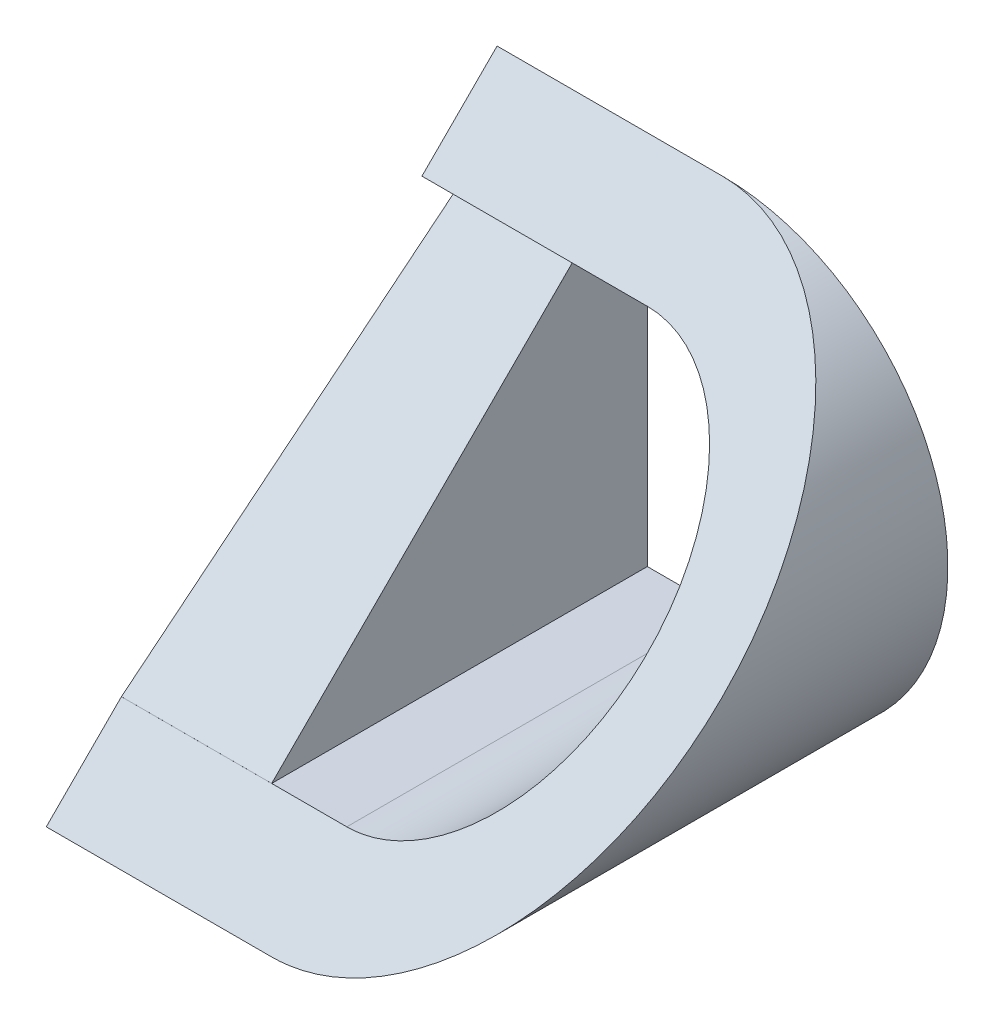
ISO-10303-21;
HEADER;
FILE_DESCRIPTION(('STEP AP214'),'2;1');
FILE_NAME('part.step','',(''),(''),'','','');
FILE_SCHEMA(('AUTOMOTIVE_DESIGN { 1 0 10303 214 1 1 1 1 }'));
ENDSEC;
DATA;
#1=APPLICATION_CONTEXT('core data for automotive mechanical design processes');
#2=APPLICATION_PROTOCOL_DEFINITION('international standard','automotive_design',2000,#1);
#3=PRODUCT_CONTEXT('',#1,'mechanical');
#4=PRODUCT('Part','Part','',(#3));
#5=PRODUCT_RELATED_PRODUCT_CATEGORY('part','',(#4));
#6=PRODUCT_DEFINITION_FORMATION('','',#4);
#7=PRODUCT_DEFINITION_CONTEXT('part definition',#1,'design');
#8=PRODUCT_DEFINITION('design','',#6,#7);
#9=PRODUCT_DEFINITION_SHAPE('','',#8);
#10=(LENGTH_UNIT() NAMED_UNIT(*) SI_UNIT(.MILLI.,.METRE.));
#11=(NAMED_UNIT(*) PLANE_ANGLE_UNIT() SI_UNIT($,.RADIAN.));
#12=(NAMED_UNIT(*) SI_UNIT($,.STERADIAN.) SOLID_ANGLE_UNIT());
#13=UNCERTAINTY_MEASURE_WITH_UNIT(LENGTH_MEASURE(1.E-05),#10,'distance_accuracy_value','');
#14=(GEOMETRIC_REPRESENTATION_CONTEXT(3) GLOBAL_UNCERTAINTY_ASSIGNED_CONTEXT((#13)) GLOBAL_UNIT_ASSIGNED_CONTEXT((#10,
#11,#12)) REPRESENTATION_CONTEXT('',''));
#15=CARTESIAN_POINT('',(0.,0.,0.));
#16=DIRECTION('',(0.,0.,1.));
#17=DIRECTION('',(1.,0.,0.));
#18=AXIS2_PLACEMENT_3D('',#15,#16,#17);
#19=CARTESIAN_POINT('',(30.,30.,60.));
#20=DIRECTION('',(0.,0.,-1.));
#21=DIRECTION('',(-1.,0.,0.));
#22=AXIS2_PLACEMENT_3D('',#19,#20,#21);
#23=CYLINDRICAL_SURFACE('',#22,30.);
#24=CARTESIAN_POINT('',(30.,30.,30.));
#25=DIRECTION('',(0.,-0.707106781186547,-0.707106781186547));
#26=DIRECTION('',(0.,0.707106781186548,-0.707106781186548));
#27=AXIS2_PLACEMENT_3D('',#24,#25,#26);
#28=ELLIPSE('',#27,42.4264068711929,30.);
#29=CARTESIAN_POINT('',(30.,0.,60.));
#30=VERTEX_POINT('',#29);
#31=CARTESIAN_POINT('',(30.,60.,0.));
#32=VERTEX_POINT('',#31);
#33=EDGE_CURVE('E167',#30,#32,#28,.F.);
#34=ORIENTED_EDGE('',*,*,#33,.F.);
#35=DIRECTION('',(0.,0.,-1.));
#36=VECTOR('',#35,1.);
#37=CARTESIAN_POINT('',(30.,0.,60.));
#38=LINE('',#37,#36);
#39=CARTESIAN_POINT('',(30.,0.,0.));
#40=VERTEX_POINT('',#39);
#41=EDGE_CURVE('E172',#30,#40,#38,.T.);
#42=ORIENTED_EDGE('',*,*,#41,.T.);
#43=CARTESIAN_POINT('',(30.,30.,0.));
#44=DIRECTION('',(0.,0.,1.));
#45=DIRECTION('',(1.,0.,0.));
#46=AXIS2_PLACEMENT_3D('',#43,#44,#45);
#47=CIRCLE('',#46,30.);
#48=EDGE_CURVE('E169',#32,#40,#47,.F.);
#49=ORIENTED_EDGE('',*,*,#48,.F.);
#50=EDGE_LOOP('',(#34,#42,#49));
#51=FACE_BOUND('',#50,.T.);
#52=ADVANCED_FACE('F35',(#51),#23,.T.);
#53=CARTESIAN_POINT('',(0.,0.,60.));
#54=DIRECTION('',(-1.,0.,0.));
#55=DIRECTION('',(0.,0.,1.));
#56=AXIS2_PLACEMENT_3D('',#53,#54,#55);
#57=PLANE('',#56);
#58=DIRECTION('',(0.,0.,1.));
#59=VECTOR('',#58,1.);
#60=CARTESIAN_POINT('',(0.,10.00000000225,49.99999999775));
#61=LINE('',#60,#59);
#62=CARTESIAN_POINT('',(0.,10.00000000225,49.9969073546457));
#63=VERTEX_POINT('',#62);
#64=CARTESIAN_POINT('',(0.,10.00000000225,49.99999999775));
#65=VERTEX_POINT('',#64);
#66=EDGE_CURVE('E134',#63,#65,#61,.T.);
#67=ORIENTED_EDGE('',*,*,#66,.F.);
#68=DIRECTION('',(0.,-0.6304550625421,0.77622574945375));
#69=VECTOR('',#68,1.);
#70=CARTESIAN_POINT('',(0.,10.00000000225,49.9969073546457));
#71=LINE('',#70,#69);
#72=CARTESIAN_POINT('',(0.,50.,0.748306112221542));
#73=VERTEX_POINT('',#72);
#74=EDGE_CURVE('E241',#73,#63,#71,.T.);
#75=ORIENTED_EDGE('',*,*,#74,.F.);
#76=DIRECTION('',(0.,0.,-1.));
#77=VECTOR('',#76,1.);
#78=CARTESIAN_POINT('',(0.,50.,0.748306112221542));
#79=LINE('',#78,#77);
#80=CARTESIAN_POINT('',(0.,50.,10.));
#81=VERTEX_POINT('',#80);
#82=EDGE_CURVE('E239',#81,#73,#79,.T.);
#83=ORIENTED_EDGE('',*,*,#82,.F.);
#84=DIRECTION('',(0.,-0.707106781186547,0.707106781186547));
#85=VECTOR('',#84,1.);
#86=CARTESIAN_POINT('',(0.,60.,0.));
#87=LINE('',#86,#85);
#88=CARTESIAN_POINT('',(0.,60.,0.));
#89=VERTEX_POINT('',#88);
#90=EDGE_CURVE('E139',#89,#81,#87,.T.);
#91=ORIENTED_EDGE('',*,*,#90,.F.);
#92=DIRECTION('',(0.,1.,0.));
#93=VECTOR('',#92,1.);
#94=CARTESIAN_POINT('',(0.,0.,0.));
#95=LINE('',#94,#93);
#96=CARTESIAN_POINT('',(0.,0.,0.));
#97=VERTEX_POINT('',#96);
#98=EDGE_CURVE('E179',#97,#89,#95,.T.);
#99=ORIENTED_EDGE('',*,*,#98,.F.);
#100=DIRECTION('',(0.,0.,-1.));
#101=VECTOR('',#100,1.);
#102=CARTESIAN_POINT('',(0.,0.,60.));
#103=LINE('',#102,#101);
#104=CARTESIAN_POINT('',(0.,0.,60.));
#105=VERTEX_POINT('',#104);
#106=EDGE_CURVE('E185',#105,#97,#103,.T.);
#107=ORIENTED_EDGE('',*,*,#106,.F.);
#108=EDGE_CURVE('E160',#65,#105,#87,.T.);
#109=ORIENTED_EDGE('',*,*,#108,.F.);
#110=EDGE_LOOP('',(#67,#75,#83,#91,#99,#107,#109));
#111=FACE_BOUND('',#110,.T.);
#112=ADVANCED_FACE('F221',(#111),#57,.T.);
#113=CARTESIAN_POINT('',(0.,0.,60.));
#114=DIRECTION('',(0.,1.,0.));
#115=DIRECTION('',(0.,0.,1.));
#116=AXIS2_PLACEMENT_3D('',#113,#114,#115);
#117=PLANE('',#116);
#118=DIRECTION('',(1.,0.,0.));
#119=VECTOR('',#118,1.);
#120=CARTESIAN_POINT('',(0.,0.,0.));
#121=LINE('',#120,#119);
#122=EDGE_CURVE('E173',#97,#40,#121,.T.);
#123=ORIENTED_EDGE('',*,*,#122,.T.);
#124=ORIENTED_EDGE('',*,*,#41,.F.);
#125=DIRECTION('',(1.,0.,0.));
#126=VECTOR('',#125,1.);
#127=CARTESIAN_POINT('',(0.,0.,60.));
#128=LINE('',#127,#126);
#129=EDGE_CURVE('E170',#105,#30,#128,.T.);
#130=ORIENTED_EDGE('',*,*,#129,.F.);
#131=ORIENTED_EDGE('',*,*,#106,.T.);
#132=EDGE_LOOP('',(#123,#124,#130,#131));
#133=FACE_BOUND('',#132,.T.);
#134=ADVANCED_FACE('F227',(#133),#117,.F.);
#135=CARTESIAN_POINT('',(0.,0.,0.));
#136=DIRECTION('',(0.,0.,1.));
#137=DIRECTION('',(1.,0.,0.));
#138=AXIS2_PLACEMENT_3D('',#135,#136,#137);
#139=PLANE('',#138);
#140=DIRECTION('',(-1.,0.,0.));
#141=VECTOR('',#140,1.);
#142=CARTESIAN_POINT('',(20.0003,10.00000000225,0.));
#143=LINE('',#142,#141);
#144=CARTESIAN_POINT('',(30.0003,10.00000000225,0.));
#145=VERTEX_POINT('',#144);
#146=CARTESIAN_POINT('',(20.0003,10.00000000225,0.));
#147=VERTEX_POINT('',#146);
#148=EDGE_CURVE('E147',#145,#147,#143,.T.);
#149=ORIENTED_EDGE('',*,*,#148,.F.);
#150=CARTESIAN_POINT('',(30.,30.,0.));
#151=DIRECTION('',(0.,0.,-1.));
#152=DIRECTION('',(-1.,0.,0.));
#153=AXIS2_PLACEMENT_3D('',#150,#151,#152);
#154=CIRCLE('',#153,20.);
#155=CARTESIAN_POINT('',(30.,50.,0.));
#156=VERTEX_POINT('',#155);
#157=EDGE_CURVE('E57',#156,#145,#154,.T.);
#158=ORIENTED_EDGE('',*,*,#157,.F.);
#159=DIRECTION('',(1.,0.,0.));
#160=VECTOR('',#159,1.);
#161=CARTESIAN_POINT('',(30.,50.,0.));
#162=LINE('',#161,#160);
#163=CARTESIAN_POINT('',(20.0003,50.,0.));
#164=VERTEX_POINT('',#163);
#165=EDGE_CURVE('E154',#164,#156,#162,.T.);
#166=ORIENTED_EDGE('',*,*,#165,.F.);
#167=DIRECTION('',(0.,1.,0.));
#168=VECTOR('',#167,1.);
#169=CARTESIAN_POINT('',(20.0003,50.,0.));
#170=LINE('',#169,#168);
#171=EDGE_CURVE('E151',#147,#164,#170,.T.);
#172=ORIENTED_EDGE('',*,*,#171,.F.);
#173=EDGE_LOOP('',(#149,#158,#166,#172));
#174=FACE_BOUND('',#173,.T.);
#175=ORIENTED_EDGE('',*,*,#48,.T.);
#176=ORIENTED_EDGE('',*,*,#122,.F.);
#177=ORIENTED_EDGE('',*,*,#98,.T.);
#178=DIRECTION('',(1.,0.,0.));
#179=VECTOR('',#178,1.);
#180=CARTESIAN_POINT('',(0.,60.,0.));
#181=LINE('',#180,#179);
#182=EDGE_CURVE('E176',#89,#32,#181,.T.);
#183=ORIENTED_EDGE('',*,*,#182,.T.);
#184=EDGE_LOOP('',(#175,#176,#177,#183));
#185=FACE_BOUND('',#184,.T.);
#186=ADVANCED_FACE('F205',(#174,#185),#139,.F.);
#187=CARTESIAN_POINT('',(60.,60.,0.));
#188=DIRECTION('',(0.,-0.707106781186547,-0.707106781186547));
#189=DIRECTION('',(0.,0.707106781186548,-0.707106781186548));
#190=AXIS2_PLACEMENT_3D('',#187,#188,#189);
#191=PLANE('',#190);
#192=DIRECTION('',(1.,0.,0.));
#193=VECTOR('',#192,1.);
#194=CARTESIAN_POINT('',(60.,50.,9.99999999999999));
#195=LINE('',#194,#193);
#196=CARTESIAN_POINT('',(20.0003,50.,10.));
#197=VERTEX_POINT('',#196);
#198=CARTESIAN_POINT('',(30.,50.,9.99999999999999));
#199=VERTEX_POINT('',#198);
#200=EDGE_CURVE('E42',#197,#199,#195,.T.);
#201=ORIENTED_EDGE('',*,*,#200,.T.);
#202=CARTESIAN_POINT('',(30.,30.,30.));
#203=DIRECTION('',(0.,-0.707106781186547,-0.707106781186547));
#204=DIRECTION('',(0.,0.707106781186548,-0.707106781186548));
#205=AXIS2_PLACEMENT_3D('',#202,#203,#204);
#206=ELLIPSE('',#205,28.2842712474619,20.);
#207=CARTESIAN_POINT('',(30.0003,10.00000000225,49.99999999775));
#208=VERTEX_POINT('',#207);
#209=EDGE_CURVE('E11',#199,#208,#206,.T.);
#210=ORIENTED_EDGE('',*,*,#209,.T.);
#211=DIRECTION('',(-1.,0.,0.));
#212=VECTOR('',#211,1.);
#213=CARTESIAN_POINT('',(60.,10.00000000225,49.99999999775));
#214=LINE('',#213,#212);
#215=CARTESIAN_POINT('',(20.0003,10.00000000225,49.99999999775));
#216=VERTEX_POINT('',#215);
#217=EDGE_CURVE('E187',#208,#216,#214,.T.);
#218=ORIENTED_EDGE('',*,*,#217,.T.);
#219=DIRECTION('',(0.,0.707106781186548,-0.707106781186548));
#220=VECTOR('',#219,1.);
#221=CARTESIAN_POINT('',(20.0003,60.,0.));
#222=LINE('',#221,#220);
#223=EDGE_CURVE('E190',#216,#197,#222,.T.);
#224=ORIENTED_EDGE('',*,*,#223,.T.);
#225=EDGE_LOOP('',(#201,#210,#218,#224));
#226=FACE_BOUND('',#225,.T.);
#227=DIRECTION('',(0.,0.707106781186548,-0.707106781186547));
#228=VECTOR('',#227,1.);
#229=CARTESIAN_POINT('',(20.,50.,10.));
#230=LINE('',#229,#228);
#231=CARTESIAN_POINT('',(20.,10.00000000225,49.99999999775));
#232=VERTEX_POINT('',#231);
#233=CARTESIAN_POINT('',(20.,50.,10.));
#234=VERTEX_POINT('',#233);
#235=EDGE_CURVE('E128',#232,#234,#230,.T.);
#236=ORIENTED_EDGE('',*,*,#235,.F.);
#237=DIRECTION('',(-1.,0.,0.));
#238=VECTOR('',#237,1.);
#239=CARTESIAN_POINT('',(20.,10.00000000225,49.99999999775));
#240=LINE('',#239,#238);
#241=EDGE_CURVE('E148',#232,#65,#240,.T.);
#242=ORIENTED_EDGE('',*,*,#241,.T.);
#243=ORIENTED_EDGE('',*,*,#108,.T.);
#244=ORIENTED_EDGE('',*,*,#129,.T.);
#245=ORIENTED_EDGE('',*,*,#33,.T.);
#246=ORIENTED_EDGE('',*,*,#182,.F.);
#247=ORIENTED_EDGE('',*,*,#90,.T.);
#248=DIRECTION('',(-1.,0.,0.));
#249=VECTOR('',#248,1.);
#250=CARTESIAN_POINT('',(20.,50.,10.));
#251=LINE('',#250,#249);
#252=EDGE_CURVE('E123',#234,#81,#251,.T.);
#253=ORIENTED_EDGE('',*,*,#252,.F.);
#254=EDGE_LOOP('',(#236,#242,#243,#244,#245,#246,#247,#253));
#255=FACE_BOUND('',#254,.T.);
#256=ADVANCED_FACE('F137',(#226,#255),#191,.F.);
#257=CARTESIAN_POINT('',(30.,30.,60.));
#258=DIRECTION('',(0.,0.,-1.));
#259=DIRECTION('',(-1.,0.,0.));
#260=AXIS2_PLACEMENT_3D('',#257,#258,#259);
#261=CYLINDRICAL_SURFACE('',#260,20.);
#262=DIRECTION('',(0.,0.,-1.));
#263=VECTOR('',#262,1.);
#264=CARTESIAN_POINT('',(30.,50.,60.));
#265=LINE('',#264,#263);
#266=EDGE_CURVE('E158',#199,#156,#265,.T.);
#267=ORIENTED_EDGE('',*,*,#266,.T.);
#268=ORIENTED_EDGE('',*,*,#157,.T.);
#269=DIRECTION('',(0.,0.,-1.));
#270=VECTOR('',#269,1.);
#271=CARTESIAN_POINT('',(30.0003,10.00000000225,60.));
#272=LINE('',#271,#270);
#273=EDGE_CURVE('E157',#208,#145,#272,.T.);
#274=ORIENTED_EDGE('',*,*,#273,.F.);
#275=ORIENTED_EDGE('',*,*,#209,.F.);
#276=EDGE_LOOP('',(#267,#268,#274,#275));
#277=FACE_BOUND('',#276,.T.);
#278=ADVANCED_FACE('F209',(#277),#261,.F.);
#279=CARTESIAN_POINT('',(30.,50.,60.));
#280=DIRECTION('',(0.,1.,0.));
#281=DIRECTION('',(0.,0.,1.));
#282=AXIS2_PLACEMENT_3D('',#279,#280,#281);
#283=PLANE('',#282);
#284=DIRECTION('',(0.,0.,-1.));
#285=VECTOR('',#284,1.);
#286=CARTESIAN_POINT('',(20.0003,50.,60.));
#287=LINE('',#286,#285);
#288=EDGE_CURVE('E161',#197,#164,#287,.T.);
#289=ORIENTED_EDGE('',*,*,#288,.T.);
#290=ORIENTED_EDGE('',*,*,#165,.T.);
#291=ORIENTED_EDGE('',*,*,#266,.F.);
#292=ORIENTED_EDGE('',*,*,#200,.F.);
#293=EDGE_LOOP('',(#289,#290,#291,#292));
#294=FACE_BOUND('',#293,.T.);
#295=ADVANCED_FACE('F198',(#294),#283,.F.);
#296=CARTESIAN_POINT('',(20.0003,50.,60.));
#297=DIRECTION('',(-1.,0.,0.));
#298=DIRECTION('',(0.,-1.,0.));
#299=AXIS2_PLACEMENT_3D('',#296,#297,#298);
#300=PLANE('',#299);
#301=DIRECTION('',(0.,0.,-1.));
#302=VECTOR('',#301,1.);
#303=CARTESIAN_POINT('',(20.0003,10.00000000225,60.));
#304=LINE('',#303,#302);
#305=EDGE_CURVE('E163',#216,#147,#304,.T.);
#306=ORIENTED_EDGE('',*,*,#305,.T.);
#307=ORIENTED_EDGE('',*,*,#171,.T.);
#308=ORIENTED_EDGE('',*,*,#288,.F.);
#309=ORIENTED_EDGE('',*,*,#223,.F.);
#310=EDGE_LOOP('',(#306,#307,#308,#309));
#311=FACE_BOUND('',#310,.T.);
#312=ADVANCED_FACE('F200',(#311),#300,.F.);
#313=CARTESIAN_POINT('',(20.0003,10.00000000225,60.));
#314=DIRECTION('',(0.,-1.,0.));
#315=DIRECTION('',(1.,0.,0.));
#316=AXIS2_PLACEMENT_3D('',#313,#314,#315);
#317=PLANE('',#316);
#318=ORIENTED_EDGE('',*,*,#273,.T.);
#319=ORIENTED_EDGE('',*,*,#148,.T.);
#320=ORIENTED_EDGE('',*,*,#305,.F.);
#321=ORIENTED_EDGE('',*,*,#217,.F.);
#322=EDGE_LOOP('',(#318,#319,#320,#321));
#323=FACE_BOUND('',#322,.T.);
#324=ADVANCED_FACE('F208',(#323),#317,.F.);
#325=CARTESIAN_POINT('',(20.,10.00000000225,49.99999999775));
#326=DIRECTION('',(0.,-1.,0.));
#327=DIRECTION('',(0.,0.,-1.));
#328=AXIS2_PLACEMENT_3D('',#325,#326,#327);
#329=PLANE('',#328);
#330=ORIENTED_EDGE('',*,*,#66,.T.);
#331=ORIENTED_EDGE('',*,*,#241,.F.);
#332=DIRECTION('',(0.,0.,1.));
#333=VECTOR('',#332,1.);
#334=CARTESIAN_POINT('',(20.,10.00000000225,49.99999999775));
#335=LINE('',#334,#333);
#336=CARTESIAN_POINT('',(20.,10.00000000225,49.9969073546457));
#337=VERTEX_POINT('',#336);
#338=EDGE_CURVE('E49',#337,#232,#335,.T.);
#339=ORIENTED_EDGE('',*,*,#338,.F.);
#340=DIRECTION('',(-1.,0.,0.));
#341=VECTOR('',#340,1.);
#342=CARTESIAN_POINT('',(20.,10.00000000225,49.9969073546457));
#343=LINE('',#342,#341);
#344=EDGE_CURVE('E141',#337,#63,#343,.T.);
#345=ORIENTED_EDGE('',*,*,#344,.T.);
#346=EDGE_LOOP('',(#330,#331,#339,#345));
#347=FACE_BOUND('',#346,.T.);
#348=ADVANCED_FACE('F248',(#347),#329,.F.);
#349=CARTESIAN_POINT('',(20.,10.00000000225,49.9969073546457));
#350=DIRECTION('',(0.,-0.77622574945375,-0.6304550625421));
#351=DIRECTION('',(0.,0.6304550625421,-0.77622574945375));
#352=AXIS2_PLACEMENT_3D('',#349,#350,#351);
#353=PLANE('',#352);
#354=ORIENTED_EDGE('',*,*,#74,.T.);
#355=ORIENTED_EDGE('',*,*,#344,.F.);
#356=DIRECTION('',(0.,-0.6304550625421,0.77622574945375));
#357=VECTOR('',#356,1.);
#358=CARTESIAN_POINT('',(20.,10.00000000225,49.9969073546457));
#359=LINE('',#358,#357);
#360=CARTESIAN_POINT('',(20.,50.,0.748306112221542));
#361=VERTEX_POINT('',#360);
#362=EDGE_CURVE('E127',#361,#337,#359,.T.);
#363=ORIENTED_EDGE('',*,*,#362,.F.);
#364=DIRECTION('',(-1.,0.,0.));
#365=VECTOR('',#364,1.);
#366=CARTESIAN_POINT('',(20.,50.,0.748306112221542));
#367=LINE('',#366,#365);
#368=EDGE_CURVE('E125',#361,#73,#367,.T.);
#369=ORIENTED_EDGE('',*,*,#368,.T.);
#370=EDGE_LOOP('',(#354,#355,#363,#369));
#371=FACE_BOUND('',#370,.T.);
#372=ADVANCED_FACE('F250',(#371),#353,.F.);
#373=CARTESIAN_POINT('',(20.,50.,0.748306112221542));
#374=DIRECTION('',(0.,1.,0.));
#375=DIRECTION('',(0.,0.,1.));
#376=AXIS2_PLACEMENT_3D('',#373,#374,#375);
#377=PLANE('',#376);
#378=ORIENTED_EDGE('',*,*,#82,.T.);
#379=ORIENTED_EDGE('',*,*,#368,.F.);
#380=DIRECTION('',(0.,0.,-1.));
#381=VECTOR('',#380,1.);
#382=CARTESIAN_POINT('',(20.,50.,0.748306112221542));
#383=LINE('',#382,#381);
#384=EDGE_CURVE('E119',#234,#361,#383,.T.);
#385=ORIENTED_EDGE('',*,*,#384,.F.);
#386=ORIENTED_EDGE('',*,*,#252,.T.);
#387=EDGE_LOOP('',(#378,#379,#385,#386));
#388=FACE_BOUND('',#387,.T.);
#389=ADVANCED_FACE('F121',(#388),#377,.F.);
#390=CARTESIAN_POINT('',(20.,0.,0.));
#391=DIRECTION('',(1.,0.,0.));
#392=DIRECTION('',(0.,0.,-1.));
#393=AXIS2_PLACEMENT_3D('',#390,#391,#392);
#394=PLANE('',#393);
#395=ORIENTED_EDGE('',*,*,#235,.T.);
#396=ORIENTED_EDGE('',*,*,#384,.T.);
#397=ORIENTED_EDGE('',*,*,#362,.T.);
#398=ORIENTED_EDGE('',*,*,#338,.T.);
#399=EDGE_LOOP('',(#395,#396,#397,#398));
#400=FACE_BOUND('',#399,.T.);
#401=ADVANCED_FACE('F131',(#400),#394,.F.);
#402=CLOSED_SHELL('',(#52,#112,#134,#186,#256,#278,#295,#312,#324,#348,#372,#389,#401));
#403=MANIFOLD_SOLID_BREP('B2',#402);
#404=ADVANCED_BREP_SHAPE_REPRESENTATION('',(#18,#403),#14);
#405=SHAPE_DEFINITION_REPRESENTATION(#9,#404);
ENDSEC;
END-ISO-10303-21;
